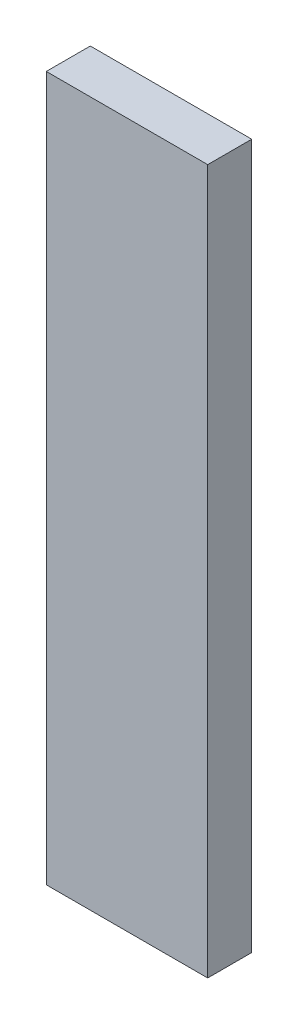
ISO-10303-21;
HEADER;
FILE_DESCRIPTION(('STEP AP214'),'2;1');
FILE_NAME('part.step','',(''),(''),'','','');
FILE_SCHEMA(('AUTOMOTIVE_DESIGN { 1 0 10303 214 1 1 1 1 }'));
ENDSEC;
DATA;
#1=APPLICATION_CONTEXT('core data for automotive mechanical design processes');
#2=APPLICATION_PROTOCOL_DEFINITION('international standard','automotive_design',2000,#1);
#3=PRODUCT_CONTEXT('',#1,'mechanical');
#4=PRODUCT('Part','Part','',(#3));
#5=PRODUCT_RELATED_PRODUCT_CATEGORY('part','',(#4));
#6=PRODUCT_DEFINITION_FORMATION('','',#4);
#7=PRODUCT_DEFINITION_CONTEXT('part definition',#1,'design');
#8=PRODUCT_DEFINITION('design','',#6,#7);
#9=PRODUCT_DEFINITION_SHAPE('','',#8);
#10=(LENGTH_UNIT() NAMED_UNIT(*) SI_UNIT(.MILLI.,.METRE.));
#11=(NAMED_UNIT(*) PLANE_ANGLE_UNIT() SI_UNIT($,.RADIAN.));
#12=(NAMED_UNIT(*) SI_UNIT($,.STERADIAN.) SOLID_ANGLE_UNIT());
#13=UNCERTAINTY_MEASURE_WITH_UNIT(LENGTH_MEASURE(1.E-05),#10,'distance_accuracy_value','');
#14=(GEOMETRIC_REPRESENTATION_CONTEXT(3) GLOBAL_UNCERTAINTY_ASSIGNED_CONTEXT((#13)) GLOBAL_UNIT_ASSIGNED_CONTEXT((#10,
#11,#12)) REPRESENTATION_CONTEXT('',''));
#15=CARTESIAN_POINT('',(0.,0.,0.));
#16=DIRECTION('',(0.,0.,1.));
#17=DIRECTION('',(1.,0.,0.));
#18=AXIS2_PLACEMENT_3D('',#15,#16,#17);
#19=CARTESIAN_POINT('',(-69.85,609.6,19.05));
#20=DIRECTION('',(-1.,0.,0.));
#21=DIRECTION('',(0.,0.,1.));
#22=AXIS2_PLACEMENT_3D('',#19,#20,#21);
#23=PLANE('',#22);
#24=DIRECTION('',(0.,0.,-1.));
#25=VECTOR('',#24,1.);
#26=CARTESIAN_POINT('',(-69.85,0.,19.05));
#27=LINE('',#26,#25);
#28=CARTESIAN_POINT('',(-69.85,0.,19.05));
#29=VERTEX_POINT('',#28);
#30=CARTESIAN_POINT('',(-69.85,0.,-19.05));
#31=VERTEX_POINT('',#30);
#32=EDGE_CURVE('E102',#29,#31,#27,.T.);
#33=ORIENTED_EDGE('',*,*,#32,.F.);
#34=DIRECTION('',(0.,-1.,0.));
#35=VECTOR('',#34,1.);
#36=CARTESIAN_POINT('',(-69.85,609.6,19.05));
#37=LINE('',#36,#35);
#38=CARTESIAN_POINT('',(-69.85,609.6,19.05));
#39=VERTEX_POINT('',#38);
#40=EDGE_CURVE('E11',#39,#29,#37,.T.);
#41=ORIENTED_EDGE('',*,*,#40,.F.);
#42=DIRECTION('',(0.,0.,-1.));
#43=VECTOR('',#42,1.);
#44=CARTESIAN_POINT('',(-69.85,609.6,19.05));
#45=LINE('',#44,#43);
#46=CARTESIAN_POINT('',(-69.85,609.6,-19.05));
#47=VERTEX_POINT('',#46);
#48=EDGE_CURVE('E97',#39,#47,#45,.T.);
#49=ORIENTED_EDGE('',*,*,#48,.T.);
#50=DIRECTION('',(0.,-1.,0.));
#51=VECTOR('',#50,1.);
#52=CARTESIAN_POINT('',(-69.85,609.6,-19.05));
#53=LINE('',#52,#51);
#54=EDGE_CURVE('E40',#47,#31,#53,.T.);
#55=ORIENTED_EDGE('',*,*,#54,.T.);
#56=EDGE_LOOP('',(#33,#41,#49,#55));
#57=FACE_BOUND('',#56,.T.);
#58=ADVANCED_FACE('F37',(#57),#23,.T.);
#59=CARTESIAN_POINT('',(-69.85,609.6,19.05));
#60=DIRECTION('',(0.,0.,-1.));
#61=DIRECTION('',(-1.,0.,0.));
#62=AXIS2_PLACEMENT_3D('',#59,#60,#61);
#63=PLANE('',#62);
#64=DIRECTION('',(1.,0.,0.));
#65=VECTOR('',#64,1.);
#66=CARTESIAN_POINT('',(-69.85,0.,19.05));
#67=LINE('',#66,#65);
#68=CARTESIAN_POINT('',(69.85,0.,19.05));
#69=VERTEX_POINT('',#68);
#70=EDGE_CURVE('E70',#29,#69,#67,.T.);
#71=ORIENTED_EDGE('',*,*,#70,.T.);
#72=DIRECTION('',(0.,-1.,0.));
#73=VECTOR('',#72,1.);
#74=CARTESIAN_POINT('',(69.85,609.6,19.05));
#75=LINE('',#74,#73);
#76=CARTESIAN_POINT('',(69.85,609.6,19.05));
#77=VERTEX_POINT('',#76);
#78=EDGE_CURVE('E46',#77,#69,#75,.T.);
#79=ORIENTED_EDGE('',*,*,#78,.F.);
#80=DIRECTION('',(1.,0.,0.));
#81=VECTOR('',#80,1.);
#82=CARTESIAN_POINT('',(-69.85,609.6,19.05));
#83=LINE('',#82,#81);
#84=EDGE_CURVE('E87',#39,#77,#83,.T.);
#85=ORIENTED_EDGE('',*,*,#84,.F.);
#86=ORIENTED_EDGE('',*,*,#40,.T.);
#87=EDGE_LOOP('',(#71,#79,#85,#86));
#88=FACE_BOUND('',#87,.T.);
#89=ADVANCED_FACE('F112',(#88),#63,.F.);
#90=CARTESIAN_POINT('',(69.85,609.6,19.05));
#91=DIRECTION('',(-1.,0.,0.));
#92=DIRECTION('',(0.,0.,1.));
#93=AXIS2_PLACEMENT_3D('',#90,#91,#92);
#94=PLANE('',#93);
#95=DIRECTION('',(0.,0.,-1.));
#96=VECTOR('',#95,1.);
#97=CARTESIAN_POINT('',(69.85,0.,19.05));
#98=LINE('',#97,#96);
#99=CARTESIAN_POINT('',(69.85,0.,-19.05));
#100=VERTEX_POINT('',#99);
#101=EDGE_CURVE('E94',#69,#100,#98,.T.);
#102=ORIENTED_EDGE('',*,*,#101,.T.);
#103=DIRECTION('',(0.,-1.,0.));
#104=VECTOR('',#103,1.);
#105=CARTESIAN_POINT('',(69.85,609.6,-19.05));
#106=LINE('',#105,#104);
#107=CARTESIAN_POINT('',(69.85,609.6,-19.05));
#108=VERTEX_POINT('',#107);
#109=EDGE_CURVE('E91',#108,#100,#106,.T.);
#110=ORIENTED_EDGE('',*,*,#109,.F.);
#111=DIRECTION('',(0.,0.,-1.));
#112=VECTOR('',#111,1.);
#113=CARTESIAN_POINT('',(69.85,609.6,19.05));
#114=LINE('',#113,#112);
#115=EDGE_CURVE('E82',#77,#108,#114,.T.);
#116=ORIENTED_EDGE('',*,*,#115,.F.);
#117=ORIENTED_EDGE('',*,*,#78,.T.);
#118=EDGE_LOOP('',(#102,#110,#116,#117));
#119=FACE_BOUND('',#118,.T.);
#120=ADVANCED_FACE('F92',(#119),#94,.F.);
#121=CARTESIAN_POINT('',(-69.85,609.6,-19.05));
#122=DIRECTION('',(0.,0.,-1.));
#123=DIRECTION('',(-1.,0.,0.));
#124=AXIS2_PLACEMENT_3D('',#121,#122,#123);
#125=PLANE('',#124);
#126=DIRECTION('',(1.,0.,0.));
#127=VECTOR('',#126,1.);
#128=CARTESIAN_POINT('',(-69.85,0.,-19.05));
#129=LINE('',#128,#127);
#130=EDGE_CURVE('E105',#31,#100,#129,.T.);
#131=ORIENTED_EDGE('',*,*,#130,.F.);
#132=ORIENTED_EDGE('',*,*,#54,.F.);
#133=DIRECTION('',(1.,0.,0.));
#134=VECTOR('',#133,1.);
#135=CARTESIAN_POINT('',(-69.85,609.6,-19.05));
#136=LINE('',#135,#134);
#137=EDGE_CURVE('E86',#47,#108,#136,.T.);
#138=ORIENTED_EDGE('',*,*,#137,.T.);
#139=ORIENTED_EDGE('',*,*,#109,.T.);
#140=EDGE_LOOP('',(#131,#132,#138,#139));
#141=FACE_BOUND('',#140,.T.);
#142=ADVANCED_FACE('F96',(#141),#125,.T.);
#143=CARTESIAN_POINT('',(0.,609.6,0.));
#144=DIRECTION('',(0.,-1.,0.));
#145=DIRECTION('',(0.,0.,-1.));
#146=AXIS2_PLACEMENT_3D('',#143,#144,#145);
#147=PLANE('',#146);
#148=ORIENTED_EDGE('',*,*,#48,.F.);
#149=ORIENTED_EDGE('',*,*,#84,.T.);
#150=ORIENTED_EDGE('',*,*,#115,.T.);
#151=ORIENTED_EDGE('',*,*,#137,.F.);
#152=EDGE_LOOP('',(#148,#149,#150,#151));
#153=FACE_BOUND('',#152,.T.);
#154=ADVANCED_FACE('F85',(#153),#147,.F.);
#155=CARTESIAN_POINT('',(0.,0.,0.));
#156=DIRECTION('',(0.,-1.,0.));
#157=DIRECTION('',(0.,0.,-1.));
#158=AXIS2_PLACEMENT_3D('',#155,#156,#157);
#159=PLANE('',#158);
#160=ORIENTED_EDGE('',*,*,#32,.T.);
#161=ORIENTED_EDGE('',*,*,#130,.T.);
#162=ORIENTED_EDGE('',*,*,#101,.F.);
#163=ORIENTED_EDGE('',*,*,#70,.F.);
#164=EDGE_LOOP('',(#160,#161,#162,#163));
#165=FACE_BOUND('',#164,.T.);
#166=ADVANCED_FACE('F110',(#165),#159,.T.);
#167=CLOSED_SHELL('',(#58,#89,#120,#142,#154,#166));
#168=MANIFOLD_SOLID_BREP('B2',#167);
#169=ADVANCED_BREP_SHAPE_REPRESENTATION('',(#18,#168),#14);
#170=SHAPE_DEFINITION_REPRESENTATION(#9,#169);
ENDSEC;
END-ISO-10303-21;
